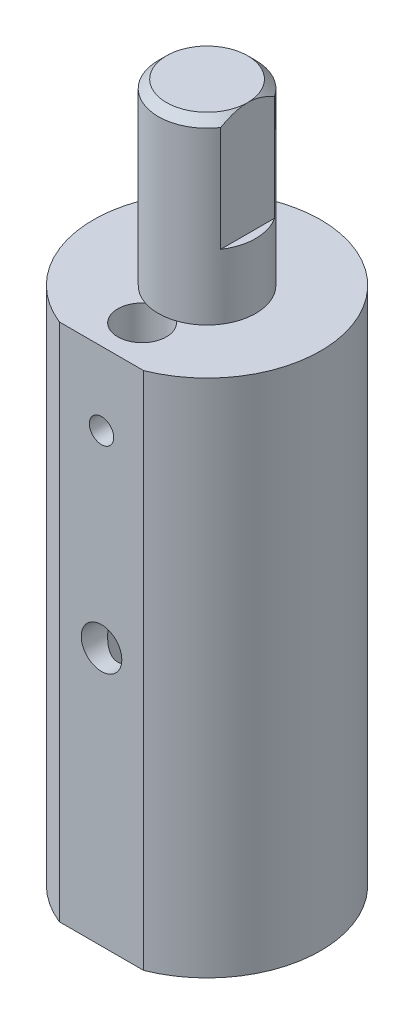
ISO-10303-21;
HEADER;
FILE_DESCRIPTION(('STEP AP214'),'2;1');
FILE_NAME('part.step','',(''),(''),'','','');
FILE_SCHEMA(('AUTOMOTIVE_DESIGN { 1 0 10303 214 1 1 1 1 }'));
ENDSEC;
DATA;
#1=APPLICATION_CONTEXT('core data for automotive mechanical design processes');
#2=APPLICATION_PROTOCOL_DEFINITION('international standard','automotive_design',2000,#1);
#3=PRODUCT_CONTEXT('',#1,'mechanical');
#4=PRODUCT('Part','Part','',(#3));
#5=PRODUCT_RELATED_PRODUCT_CATEGORY('part','',(#4));
#6=PRODUCT_DEFINITION_FORMATION('','',#4);
#7=PRODUCT_DEFINITION_CONTEXT('part definition',#1,'design');
#8=PRODUCT_DEFINITION('design','',#6,#7);
#9=PRODUCT_DEFINITION_SHAPE('','',#8);
#10=(LENGTH_UNIT() NAMED_UNIT(*) SI_UNIT(.MILLI.,.METRE.));
#11=(NAMED_UNIT(*) PLANE_ANGLE_UNIT() SI_UNIT($,.RADIAN.));
#12=(NAMED_UNIT(*) SI_UNIT($,.STERADIAN.) SOLID_ANGLE_UNIT());
#13=UNCERTAINTY_MEASURE_WITH_UNIT(LENGTH_MEASURE(1.E-05),#10,'distance_accuracy_value','');
#14=(GEOMETRIC_REPRESENTATION_CONTEXT(3) GLOBAL_UNCERTAINTY_ASSIGNED_CONTEXT((#13)) GLOBAL_UNIT_ASSIGNED_CONTEXT((#10,
#11,#12)) REPRESENTATION_CONTEXT('',''));
#15=CARTESIAN_POINT('',(0.,0.,0.));
#16=DIRECTION('',(0.,0.,1.));
#17=DIRECTION('',(1.,0.,0.));
#18=AXIS2_PLACEMENT_3D('',#15,#16,#17);
#19=CARTESIAN_POINT('',(0.,0.,0.));
#20=DIRECTION('',(0.,1.,0.));
#21=DIRECTION('',(0.,0.,1.));
#22=AXIS2_PLACEMENT_3D('',#19,#20,#21);
#23=PLANE('',#22);
#24=CARTESIAN_POINT('',(0.,0.,0.));
#25=DIRECTION('',(0.,1.,0.));
#26=DIRECTION('',(0.,0.,1.));
#27=AXIS2_PLACEMENT_3D('',#24,#25,#26);
#28=CIRCLE('',#27,14.);
#29=CARTESIAN_POINT('',(5.19615242270663,0.,13.));
#30=VERTEX_POINT('',#29);
#31=CARTESIAN_POINT('',(-5.19615242270663,0.,13.));
#32=VERTEX_POINT('',#31);
#33=EDGE_CURVE('E142',#30,#32,#28,.T.);
#34=ORIENTED_EDGE('',*,*,#33,.F.);
#35=DIRECTION('',(1.,0.,0.));
#36=VECTOR('',#35,1.);
#37=CARTESIAN_POINT('',(5.19615242270663,0.,13.));
#38=LINE('',#37,#36);
#39=EDGE_CURVE('E145',#32,#30,#38,.T.);
#40=ORIENTED_EDGE('',*,*,#39,.F.);
#41=EDGE_LOOP('',(#34,#40));
#42=FACE_BOUND('',#41,.T.);
#43=CARTESIAN_POINT('',(-9.,0.,0.));
#44=DIRECTION('',(0.,1.,0.));
#45=DIRECTION('',(0.,0.,1.));
#46=AXIS2_PLACEMENT_3D('',#43,#44,#45);
#47=CIRCLE('',#46,2.);
#48=CARTESIAN_POINT('',(-9.,0.,2.));
#49=VERTEX_POINT('',#48);
#50=EDGE_CURVE('E137',#49,#49,#47,.T.);
#51=ORIENTED_EDGE('',*,*,#50,.T.);
#52=EDGE_LOOP('',(#51));
#53=FACE_BOUND('',#52,.T.);
#54=CARTESIAN_POINT('',(9.,0.,0.));
#55=DIRECTION('',(0.,1.,0.));
#56=DIRECTION('',(0.,0.,1.));
#57=AXIS2_PLACEMENT_3D('',#54,#55,#56);
#58=CIRCLE('',#57,2.);
#59=CARTESIAN_POINT('',(9.,0.,2.));
#60=VERTEX_POINT('',#59);
#61=EDGE_CURVE('E132',#60,#60,#58,.T.);
#62=ORIENTED_EDGE('',*,*,#61,.T.);
#63=EDGE_LOOP('',(#62));
#64=FACE_BOUND('',#63,.T.);
#65=CARTESIAN_POINT('',(0.,0.,-5.));
#66=DIRECTION('',(0.,1.,0.));
#67=DIRECTION('',(0.,0.,1.));
#68=AXIS2_PLACEMENT_3D('',#65,#66,#67);
#69=CIRCLE('',#68,6.);
#70=CARTESIAN_POINT('',(0.,0.,1.));
#71=VERTEX_POINT('',#70);
#72=EDGE_CURVE('E128',#71,#71,#69,.T.);
#73=ORIENTED_EDGE('',*,*,#72,.T.);
#74=EDGE_LOOP('',(#73));
#75=FACE_BOUND('',#74,.T.);
#76=CARTESIAN_POINT('',(0.,0.,8.));
#77=DIRECTION('',(0.,1.,0.));
#78=DIRECTION('',(0.,0.,1.));
#79=AXIS2_PLACEMENT_3D('',#76,#77,#78);
#80=CIRCLE('',#79,3.);
#81=CARTESIAN_POINT('',(0.,0.,11.));
#82=VERTEX_POINT('',#81);
#83=EDGE_CURVE('E125',#82,#82,#80,.T.);
#84=ORIENTED_EDGE('',*,*,#83,.T.);
#85=EDGE_LOOP('',(#84));
#86=FACE_BOUND('',#85,.T.);
#87=ADVANCED_FACE('F35',(#42,#53,#64,#75,#86),#23,.F.);
#88=CARTESIAN_POINT('',(0.,14.,0.));
#89=DIRECTION('',(0.,-1.,0.));
#90=DIRECTION('',(0.,0.,-1.));
#91=AXIS2_PLACEMENT_3D('',#88,#89,#90);
#92=CYLINDRICAL_SURFACE('',#91,14.);
#93=ORIENTED_EDGE('',*,*,#33,.T.);
#94=DIRECTION('',(0.,-1.,0.));
#95=VECTOR('',#94,1.);
#96=CARTESIAN_POINT('',(-5.19615242270663,14.,13.));
#97=LINE('',#96,#95);
#98=CARTESIAN_POINT('',(-5.19615242270664,64.,13.));
#99=VERTEX_POINT('',#98);
#100=EDGE_CURVE('E150',#99,#32,#97,.T.);
#101=ORIENTED_EDGE('',*,*,#100,.F.);
#102=CARTESIAN_POINT('',(0.,64.,0.));
#103=DIRECTION('',(0.,1.,0.));
#104=DIRECTION('',(0.,0.,1.));
#105=AXIS2_PLACEMENT_3D('',#102,#103,#104);
#106=CIRCLE('',#105,14.);
#107=CARTESIAN_POINT('',(5.19615242270663,64.,13.));
#108=VERTEX_POINT('',#107);
#109=EDGE_CURVE('E115',#108,#99,#106,.T.);
#110=ORIENTED_EDGE('',*,*,#109,.F.);
#111=DIRECTION('',(0.,-1.,0.));
#112=VECTOR('',#111,1.);
#113=CARTESIAN_POINT('',(5.19615242270663,14.,13.));
#114=LINE('',#113,#112);
#115=EDGE_CURVE('E147',#108,#30,#114,.T.);
#116=ORIENTED_EDGE('',*,*,#115,.T.);
#117=EDGE_LOOP('',(#93,#101,#110,#116));
#118=FACE_BOUND('',#117,.T.);
#119=ADVANCED_FACE('F233',(#118),#92,.T.);
#120=CARTESIAN_POINT('',(5.19615242270663,14.,13.));
#121=DIRECTION('',(0.,0.,-1.));
#122=DIRECTION('',(-1.,0.,0.));
#123=AXIS2_PLACEMENT_3D('',#120,#121,#122);
#124=PLANE('',#123);
#125=CARTESIAN_POINT('',(0.,55.,13.));
#126=DIRECTION('',(0.,0.,1.));
#127=DIRECTION('',(1.,0.,0.));
#128=AXIS2_PLACEMENT_3D('',#125,#126,#127);
#129=CIRCLE('',#128,1.5);
#130=CARTESIAN_POINT('',(1.5,55.,13.));
#131=VERTEX_POINT('',#130);
#132=EDGE_CURVE('E256',#131,#131,#129,.T.);
#133=ORIENTED_EDGE('',*,*,#132,.F.);
#134=EDGE_LOOP('',(#133));
#135=FACE_BOUND('',#134,.T.);
#136=CARTESIAN_POINT('',(0.,31.8006063548459,13.));
#137=DIRECTION('',(0.,0.,1.));
#138=DIRECTION('',(1.,0.,0.));
#139=AXIS2_PLACEMENT_3D('',#136,#137,#138);
#140=CIRCLE('',#139,2.5);
#141=CARTESIAN_POINT('',(2.5,31.8006063548459,13.));
#142=VERTEX_POINT('',#141);
#143=EDGE_CURVE('E260',#142,#142,#140,.T.);
#144=ORIENTED_EDGE('',*,*,#143,.F.);
#145=EDGE_LOOP('',(#144));
#146=FACE_BOUND('',#145,.T.);
#147=ORIENTED_EDGE('',*,*,#39,.T.);
#148=ORIENTED_EDGE('',*,*,#115,.F.);
#149=DIRECTION('',(1.,0.,0.));
#150=VECTOR('',#149,1.);
#151=CARTESIAN_POINT('',(-5.19615242270664,64.,13.));
#152=LINE('',#151,#150);
#153=EDGE_CURVE('E118',#99,#108,#152,.T.);
#154=ORIENTED_EDGE('',*,*,#153,.F.);
#155=ORIENTED_EDGE('',*,*,#100,.T.);
#156=EDGE_LOOP('',(#147,#148,#154,#155));
#157=FACE_BOUND('',#156,.T.);
#158=ADVANCED_FACE('F239',(#135,#146,#157),#124,.F.);
#159=CARTESIAN_POINT('',(-9.,14.,0.));
#160=DIRECTION('',(0.,-1.,0.));
#161=DIRECTION('',(0.,0.,-1.));
#162=AXIS2_PLACEMENT_3D('',#159,#160,#161);
#163=CYLINDRICAL_SURFACE('',#162,2.);
#164=CARTESIAN_POINT('',(-9.,14.,0.));
#165=DIRECTION('',(0.,1.,0.));
#166=DIRECTION('',(0.,0.,1.));
#167=AXIS2_PLACEMENT_3D('',#164,#165,#166);
#168=CIRCLE('',#167,2.);
#169=CARTESIAN_POINT('',(-9.,14.,2.));
#170=VERTEX_POINT('',#169);
#171=EDGE_CURVE('E129',#170,#170,#168,.T.);
#172=ORIENTED_EDGE('',*,*,#171,.T.);
#173=EDGE_LOOP('',(#172));
#174=FACE_BOUND('',#173,.T.);
#175=ORIENTED_EDGE('',*,*,#50,.F.);
#176=EDGE_LOOP('',(#175));
#177=FACE_BOUND('',#176,.T.);
#178=ADVANCED_FACE('F245',(#174,#177),#163,.F.);
#179=CARTESIAN_POINT('',(9.,14.,0.));
#180=DIRECTION('',(0.,-1.,0.));
#181=DIRECTION('',(0.,0.,-1.));
#182=AXIS2_PLACEMENT_3D('',#179,#180,#181);
#183=CYLINDRICAL_SURFACE('',#182,2.);
#184=CARTESIAN_POINT('',(9.,14.,0.));
#185=DIRECTION('',(0.,1.,0.));
#186=DIRECTION('',(0.,0.,1.));
#187=AXIS2_PLACEMENT_3D('',#184,#185,#186);
#188=CIRCLE('',#187,2.);
#189=CARTESIAN_POINT('',(9.,14.,2.));
#190=VERTEX_POINT('',#189);
#191=EDGE_CURVE('E124',#190,#190,#188,.T.);
#192=ORIENTED_EDGE('',*,*,#191,.T.);
#193=EDGE_LOOP('',(#192));
#194=FACE_BOUND('',#193,.T.);
#195=ORIENTED_EDGE('',*,*,#61,.F.);
#196=EDGE_LOOP('',(#195));
#197=FACE_BOUND('',#196,.T.);
#198=ADVANCED_FACE('F251',(#194,#197),#183,.F.);
#199=CARTESIAN_POINT('',(0.,14.,-5.));
#200=DIRECTION('',(0.,-1.,0.));
#201=DIRECTION('',(0.,0.,-1.));
#202=AXIS2_PLACEMENT_3D('',#199,#200,#201);
#203=CYLINDRICAL_SURFACE('',#202,6.);
#204=ORIENTED_EDGE('',*,*,#72,.F.);
#205=EDGE_LOOP('',(#204));
#206=FACE_BOUND('',#205,.T.);
#207=CARTESIAN_POINT('',(0.,52.,-5.));
#208=DIRECTION('',(0.,1.,0.));
#209=DIRECTION('',(0.,0.,1.));
#210=AXIS2_PLACEMENT_3D('',#207,#208,#209);
#211=CIRCLE('',#210,6.);
#212=CARTESIAN_POINT('',(0.,52.,1.));
#213=VERTEX_POINT('',#212);
#214=EDGE_CURVE('E121',#213,#213,#211,.T.);
#215=ORIENTED_EDGE('',*,*,#214,.T.);
#216=EDGE_LOOP('',(#215));
#217=FACE_BOUND('',#216,.T.);
#218=ADVANCED_FACE('F199',(#206,#217),#203,.F.);
#219=CARTESIAN_POINT('',(0.,14.,8.));
#220=DIRECTION('',(0.,-1.,0.));
#221=DIRECTION('',(0.,0.,-1.));
#222=AXIS2_PLACEMENT_3D('',#219,#220,#221);
#223=CYLINDRICAL_SURFACE('',#222,3.);
#224=CARTESIAN_POINT('',(0.,56.5,5.));
#225=CARTESIAN_POINT('',(-0.07885794442685,56.4999950465242,5.00000429892438));
#226=CARTESIAN_POINT('',(-0.157809899546343,56.4937448903184,5.00314263470365));
#227=CARTESIAN_POINT('',(-0.313380352903344,56.4690206794877,5.01538765944264));
#228=CARTESIAN_POINT('',(-0.389994130070445,56.4505234105033,5.02450568256621));
#229=CARTESIAN_POINT('',(-0.538400317320673,56.4022092870751,5.04775580894937));
#230=CARTESIAN_POINT('',(-0.610210204408717,56.372436423628,5.06186841233694));
#231=CARTESIAN_POINT('',(-0.747708925209896,56.3026440679525,5.09381335226358));
#232=CARTESIAN_POINT('',(-0.813398240985087,56.2626253836267,5.11164539549712));
#233=CARTESIAN_POINT('',(-0.941261726642866,56.1707241257721,5.15065612612907));
#234=CARTESIAN_POINT('',(-1.00298281668317,56.1182702811405,5.17197201308694));
#235=CARTESIAN_POINT('',(-1.11716916730047,56.0042177811294,5.21510044629886));
#236=CARTESIAN_POINT('',(-1.16962737466015,55.9426122223413,5.23691335686448));
#237=CARTESIAN_POINT('',(-1.26787800067542,55.8062749757149,5.28051573203979));
#238=CARTESIAN_POINT('',(-1.31283800332746,55.7308958524811,5.30217219544802));
#239=CARTESIAN_POINT('',(-1.38925234033605,55.5724489960207,5.34071031841519));
#240=CARTESIAN_POINT('',(-1.4207163224495,55.4893868069159,5.35759538589516));
#241=CARTESIAN_POINT('',(-1.46719866328288,55.3230023418671,5.38313199443287));
#242=CARTESIAN_POINT('',(-1.48308878562066,55.2399933218989,5.3922159262443));
#243=CARTESIAN_POINT('',(-1.50064048996327,55.0720317433308,5.40227165077208));
#244=CARTESIAN_POINT('',(-1.50231613255961,54.9870811886933,5.40325145985068));
#245=CARTESIAN_POINT('',(-1.49203093075844,54.8285709635269,5.39733604614127));
#246=CARTESIAN_POINT('',(-1.48167683930523,54.7548639531654,5.3913685450698));
#247=CARTESIAN_POINT('',(-1.4504097735854,54.6104171359404,5.37385656899225));
#248=CARTESIAN_POINT('',(-1.42949343584648,54.539678282042,5.36231031752336));
#249=CARTESIAN_POINT('',(-1.37731467057901,54.4011563011515,5.33468785380888));
#250=CARTESIAN_POINT('',(-1.34582260067399,54.3334804018213,5.31851239004002));
#251=CARTESIAN_POINT('',(-1.273562531502,54.204048561115,5.28344893577895));
#252=CARTESIAN_POINT('',(-1.2327903657187,54.1422952965999,5.26455972829714));
#253=CARTESIAN_POINT('',(-1.13709908236919,54.0182181208852,5.22330263145072));
#254=CARTESIAN_POINT('',(-1.08104168755393,53.9568146896358,5.20079734644881));
#255=CARTESIAN_POINT('',(-0.959333368112064,53.8438968721136,5.15678565049389));
#256=CARTESIAN_POINT('',(-0.893677884861432,53.7923872119492,5.13527972061799));
#257=CARTESIAN_POINT('',(-0.750774758747777,53.6984715084554,5.09447019075554));
#258=CARTESIAN_POINT('',(-0.673130387399118,53.6565992913314,5.07531523756989));
#259=CARTESIAN_POINT('',(-0.510699323233199,53.5868544564355,5.04263178318137));
#260=CARTESIAN_POINT('',(-0.425918364397917,53.5589707224773,5.0290988158467));
#261=CARTESIAN_POINT('',(-0.259149737491056,53.520286894425,5.01013499387847));
#262=CARTESIAN_POINT('',(-0.177512295822491,53.5082631463798,5.00412592548035));
#263=CARTESIAN_POINT('',(-0.0131693999240289,53.4978029032983,4.99890479811345));
#264=CARTESIAN_POINT('',(0.0695355298048618,53.4993599715408,4.99968951918022));
#265=CARTESIAN_POINT('',(0.22684945797898,53.5153100326281,5.00763211619848));
#266=CARTESIAN_POINT('',(0.301589112074895,53.528698799095,5.01429131467748));
#267=CARTESIAN_POINT('',(0.447610338452911,53.5663571078427,5.0326674302774));
#268=CARTESIAN_POINT('',(0.518891528536629,53.5906278496802,5.04438490498382));
#269=CARTESIAN_POINT('',(0.658332912674358,53.6499976996496,5.07223622879618));
#270=CARTESIAN_POINT('',(0.726345595508705,53.6853865751744,5.08848677345554));
#271=CARTESIAN_POINT('',(0.855692042548907,53.7656613034699,5.12384038523874));
#272=CARTESIAN_POINT('',(0.917022944664886,53.8105512018931,5.14294466649593));
#273=CARTESIAN_POINT('',(1.03765153393382,53.9136406379961,5.18437667995703));
#274=CARTESIAN_POINT('',(1.09615811672854,53.9727143026677,5.20683672734751));
#275=CARTESIAN_POINT('',(1.20278448167828,54.0998877269166,5.2510641258677));
#276=CARTESIAN_POINT('',(1.25089707856781,54.1679936782719,5.27283098899929));
#277=CARTESIAN_POINT('',(1.33756187171853,54.3154654812595,5.31423211690266));
#278=CARTESIAN_POINT('',(1.37553824370037,54.3952168991417,5.33371205616409));
#279=CARTESIAN_POINT('',(1.43712423890206,54.5612651013625,5.36638891558798));
#280=CARTESIAN_POINT('',(1.46075237380053,54.6475532897003,5.37959392667375));
#281=CARTESIAN_POINT('',(1.49079253120031,54.8153653343271,5.39657748461297));
#282=CARTESIAN_POINT('',(1.49863949460818,54.8965513801529,5.40113924802403));
#283=CARTESIAN_POINT('',(1.5010337315643,55.0591706007468,5.40251968037595));
#284=CARTESIAN_POINT('',(1.49558676993486,55.1406036531068,5.39934170560415));
#285=CARTESIAN_POINT('',(1.47288918838997,55.2932252523002,5.38643206923385));
#286=CARTESIAN_POINT('',(1.45681247151455,55.3646507052171,5.37735358276012));
#287=CARTESIAN_POINT('',(1.41476303733662,55.5037121791365,5.35443475718521));
#288=CARTESIAN_POINT('',(1.38878713673988,55.571346973138,5.34059288645497));
#289=CARTESIAN_POINT('',(1.32572361795085,55.7059372764798,5.30857204453196));
#290=CARTESIAN_POINT('',(1.28800670672355,55.7725418527435,5.29016416406119));
#291=CARTESIAN_POINT('',(1.20322645745609,55.8989118042719,5.25147002547709));
#292=CARTESIAN_POINT('',(1.15615825686235,55.9586735957817,5.23118279306584));
#293=CARTESIAN_POINT('',(1.04730498999206,56.077212973532,5.18806515262862));
#294=CARTESIAN_POINT('',(0.984426634495895,56.1349886535254,5.16522525040058));
#295=CARTESIAN_POINT('',(0.849232209349798,56.2393944751529,5.12183371610104));
#296=CARTESIAN_POINT('',(0.776911084957799,56.2860186092049,5.10128332060707));
#297=CARTESIAN_POINT('',(0.623897395174422,56.3668545440681,5.06452985650194));
#298=CARTESIAN_POINT('',(0.543149255665099,56.4009762538547,5.04835855259101));
#299=CARTESIAN_POINT('',(0.376113151707132,56.4547122516361,5.0224798805152));
#300=CARTESIAN_POINT('',(0.289841699383652,56.4743677702086,5.01275414955398));
#301=CARTESIAN_POINT('',(0.168902919736344,56.4908461166286,5.00456807129783));
#302=CARTESIAN_POINT('',(0.135242819162348,56.4942739612995,5.00285951989624));
#303=CARTESIAN_POINT('',(0.0677275977076377,56.4988519982711,5.00057454534777));
#304=CARTESIAN_POINT('',(0.0338724714699428,56.5000021277053,4.99999815344929));
#305=CARTESIAN_POINT('',(0.,56.5,5.));
#306=B_SPLINE_CURVE_WITH_KNOTS('',3,(#224,#225,#226,#227,#228,#229,#230,#231,#232,#233,#234,
#235,#236,#237,#238,#239,#240,#241,#242,#243,#244,#245,#246,#247,#248,#249,#250,#251,#252,#253,
#254,#255,#256,#257,#258,#259,#260,#261,#262,#263,#264,#265,#266,#267,#268,#269,#270,#271,#272,
#273,#274,#275,#276,#277,#278,#279,#280,#281,#282,#283,#284,#285,#286,#287,#288,#289,#290,#291,
#292,#293,#294,#295,#296,#297,#298,#299,#300,#301,#302,#303,#304,#305),.UNSPECIFIED.,.T.,.F.,(4,
2,2,2,2,2,2,2,2,2,2,2,2,2,2,2,2,2,2,2,2,2,2,2,2,2,2,2,2,2,2,2,2,2,2,2,2,2,2,2,4),(0.,
0.236436386130439,0.473322224563796,0.709293233238446,0.945245640872353,1.19547263807714,
1.44588935648105,1.71572589646129,1.98536921847422,2.23887018210344,2.4921203599353,
2.71508568613981,2.93812205888518,3.16635360252731,3.39468781890332,3.65197412000817,
3.9093830189803,4.17874533321661,4.44789325368419,4.69474935707019,4.94148846767214,
5.16910359759183,5.39674382446398,5.63089284041848,5.86514176122509,6.12239415966628,
6.37982382923148,6.64972023242589,6.91926767918176,7.1629396125457,7.40650589797018,
7.62686895373284,7.84730293182528,8.08254685170431,8.31791341715446,8.58187864135757,
8.84598575071869,9.1119602049529,9.37717362931724,9.47872920200876,9.58028757766599),.UNSPECIFIED.);
#307=CARTESIAN_POINT('',(0.,56.5,5.));
#308=VERTEX_POINT('',#307);
#309=EDGE_CURVE('E41',#308,#308,#306,.T.);
#310=ORIENTED_EDGE('',*,*,#309,.F.);
#311=EDGE_LOOP('',(#310));
#312=FACE_BOUND('',#311,.T.);
#313=CARTESIAN_POINT('',(1.5,55.,10.5980762113533));
#314=CARTESIAN_POINT('',(1.4999945446118,54.9218382877071,10.5980830209269));
#315=CARTESIAN_POINT('',(1.49384995609983,54.8435778827124,10.6016570178163));
#316=CARTESIAN_POINT('',(1.46958481484708,54.6894591029843,10.6154354967808));
#317=CARTESIAN_POINT('',(1.45143909683127,54.6136061274349,10.6256539108334));
#318=CARTESIAN_POINT('',(1.40414992304972,54.4668225034841,10.651240199081));
#319=CARTESIAN_POINT('',(1.3750649287406,54.3958680212896,10.6665806520988));
#320=CARTESIAN_POINT('',(1.30690128806456,54.2598636970049,10.7006399722529));
#321=CARTESIAN_POINT('',(1.26782210105367,54.1948141746063,10.719359022141));
#322=CARTESIAN_POINT('',(1.17699981079633,54.0665414071637,10.7599530358616));
#323=CARTESIAN_POINT('',(1.12447805421566,54.0039112964897,10.7819609545693));
#324=CARTESIAN_POINT('',(1.00988071142171,53.8878874173899,10.8255797417856));
#325=CARTESIAN_POINT('',(0.947800388673443,53.8344982561247,10.8471904074687));
#326=CARTESIAN_POINT('',(0.81073434512182,53.7349492732785,10.8893221542942));
#327=CARTESIAN_POINT('',(0.735160783518863,53.6895193482107,10.9096715962726));
#328=CARTESIAN_POINT('',(0.576235539899258,53.6122887201314,10.9452613414929));
#329=CARTESIAN_POINT('',(0.492888807207235,53.5804794157942,10.9605048677561));
#330=CARTESIAN_POINT('',(0.327067415888969,53.5337430080484,10.9832069186636));
#331=CARTESIAN_POINT('',(0.24495268573323,53.5177757104667,10.9911422033134));
#332=CARTESIAN_POINT('',(0.0788559430467773,53.4997508219874,11.000113757691));
#333=CARTESIAN_POINT('',(-0.00512490876560224,53.4976848148064,11.0011542017688));
#334=CARTESIAN_POINT('',(-0.164748786635619,53.5071200109555,10.9964447287468));
#335=CARTESIAN_POINT('',(-0.240481798765182,53.5174570232818,10.9912774383824));
#336=CARTESIAN_POINT('',(-0.388970657877479,53.549321265857,10.9756136788962));
#337=CARTESIAN_POINT('',(-0.461726281640884,53.5708493334643,10.9651168109959));
#338=CARTESIAN_POINT('',(-0.603464087354327,53.6246238491347,10.9395737493148));
#339=CARTESIAN_POINT('',(-0.672380135272764,53.6570144697581,10.924466622938));
#340=CARTESIAN_POINT('',(-0.803965202269989,53.7313951243022,10.8910646898003));
#341=CARTESIAN_POINT('',(-0.866631973257965,53.7733885949535,10.8727687423623));
#342=CARTESIAN_POINT('',(-0.990260491347288,53.8703430272995,10.8326659159884));
#343=CARTESIAN_POINT('',(-1.05050111254404,53.926154542489,10.8106906399726));
#344=CARTESIAN_POINT('',(-1.16115655544667,54.0468845873953,10.7668151088022));
#345=CARTESIAN_POINT('',(-1.21156381736134,54.1118100584111,10.7449149239844));
#346=CARTESIAN_POINT('',(-1.30425800196332,54.2539722886361,10.7021623413873));
#347=CARTESIAN_POINT('',(-1.34582597246708,54.3317290345813,10.6814647998606));
#348=CARTESIAN_POINT('',(-1.41497866950185,54.4944065070385,10.6456317541786));
#349=CARTESIAN_POINT('',(-1.44257798731633,54.5793196495263,10.630490450691));
#350=CARTESIAN_POINT('',(-1.48077031653756,54.7468217669242,10.6091695372555));
#351=CARTESIAN_POINT('',(-1.49253768317996,54.8290616785653,10.6023748377274));
#352=CARTESIAN_POINT('',(-1.50227541991714,54.9946020122748,10.5967687904241));
#353=CARTESIAN_POINT('',(-1.50025553597254,55.0779016436797,10.5979518033397));
#354=CARTESIAN_POINT('',(-1.48355406501595,55.2334808778681,10.6075150481088));
#355=CARTESIAN_POINT('',(-1.4702817250687,55.3059691766619,10.6150938125998));
#356=CARTESIAN_POINT('',(-1.43354442694866,55.4475516794064,10.6354103232701));
#357=CARTESIAN_POINT('',(-1.41007616793542,55.5166447761199,10.6481497400755));
#358=CARTESIAN_POINT('',(-1.35247138290733,55.653116996354,10.6780433311948));
#359=CARTESIAN_POINT('',(-1.31789109553909,55.7202685252803,10.6953746486459));
#360=CARTESIAN_POINT('',(-1.23943059602371,55.8482039073085,10.7323417924587));
#361=CARTESIAN_POINT('',(-1.19554560649833,55.9089844652699,10.7519788003272));
#362=CARTESIAN_POINT('',(-1.09325575079829,56.0304681512853,10.794319976845));
#363=CARTESIAN_POINT('',(-1.03371790847246,56.0901957260765,10.8170987473143));
#364=CARTESIAN_POINT('',(-0.905106743097438,56.1991183569904,10.8610135246684));
#365=CARTESIAN_POINT('',(-0.836030211983025,56.2483098553458,10.8821489751156));
#366=CARTESIAN_POINT('',(-0.687803043838139,56.3358605889252,10.9211204253644));
#367=CARTESIAN_POINT('',(-0.608434646361172,56.3738996773164,10.9388546250804));
#368=CARTESIAN_POINT('',(-0.443283546961626,56.4357068557861,10.9682503243895));
#369=CARTESIAN_POINT('',(-0.357506552088267,56.4594874770495,10.9799171551456));
#370=CARTESIAN_POINT('',(-0.190469523495629,56.490052846262,10.9950126227282));
#371=CARTESIAN_POINT('',(-0.109517165775689,56.4981968138142,10.9990989186229));
#372=CARTESIAN_POINT('',(0.0526889789268013,56.5012648981816,11.000631955627));
#373=CARTESIAN_POINT('',(0.133942650442626,56.4961936427853,10.9980810210033));
#374=CARTESIAN_POINT('',(0.288806988475717,56.4738753898066,10.9870095325688));
#375=CARTESIAN_POINT('',(0.362568476716893,56.4574527261135,10.9788934200198));
#376=CARTESIAN_POINT('',(0.506168928275424,56.4140095010455,10.9578814049513));
#377=CARTESIAN_POINT('',(0.576007327433261,56.3869874198598,10.9449848169919));
#378=CARTESIAN_POINT('',(0.713135109367324,56.321909421751,10.9148889612218));
#379=CARTESIAN_POINT('',(0.780187714050066,56.2834310151882,10.897529257982));
#380=CARTESIAN_POINT('',(0.907161962721034,56.1970631037114,10.8603219971274));
#381=CARTESIAN_POINT('',(0.967080311122358,56.1491692763265,10.8404732983754));
#382=CARTESIAN_POINT('',(1.08437100623533,56.039804291466,10.7979291533994));
#383=CARTESIAN_POINT('',(1.1408965268089,55.9774562687842,10.7751469851755));
#384=CARTESIAN_POINT('',(1.24299493109201,55.8438239183053,10.7309461424428));
#385=CARTESIAN_POINT('',(1.28855812501508,55.7725317686985,10.709528686428));
#386=CARTESIAN_POINT('',(1.36864661967848,55.6200450301286,10.6699940795737));
#387=CARTESIAN_POINT('',(1.40277759894141,55.5386087033069,10.6520026138441));
#388=CARTESIAN_POINT('',(1.45631806425962,55.3700013934903,10.6229923449253));
#389=CARTESIAN_POINT('',(1.47577678676302,55.282850666631,10.6119502422155));
#390=CARTESIAN_POINT('',(1.49155051179662,55.162291966522,10.6029390890269));
#391=CARTESIAN_POINT('',(1.49471415744578,55.1299481584032,10.6011219350773));
#392=CARTESIAN_POINT('',(1.49894010763495,55.0650752789766,10.5986890383163));
#393=CARTESIAN_POINT('',(1.50000227159981,55.0325461954212,10.5980733758766));
#394=CARTESIAN_POINT('',(1.5,55.,10.5980762113533));
#395=B_SPLINE_CURVE_WITH_KNOTS('',3,(#313,#314,#315,#316,#317,#318,#319,#320,#321,#322,#323,
#324,#325,#326,#327,#328,#329,#330,#331,#332,#333,#334,#335,#336,#337,#338,#339,#340,#341,#342,
#343,#344,#345,#346,#347,#348,#349,#350,#351,#352,#353,#354,#355,#356,#357,#358,#359,#360,#361,
#362,#363,#364,#365,#366,#367,#368,#369,#370,#371,#372,#373,#374,#375,#376,#377,#378,#379,#380,
#381,#382,#383,#384,#385,#386,#387,#388,#389,#390,#391,#392,#393,#394),.UNSPECIFIED.,.T.,.F.,(4,
2,2,2,2,2,2,2,2,2,2,2,2,2,2,2,2,2,2,2,2,2,2,2,2,2,2,2,2,2,2,2,2,2,2,2,2,2,2,2,4),(0.,
0.234348183892072,0.469189339237203,0.702792893878319,0.93640908816771,1.18929346874734,
1.44230356626556,1.71236838358145,1.98226240445836,2.23295227451902,2.48349035529059,
2.71224146226807,2.94100968776182,3.1729430209672,3.40495949025407,3.65890787185335,
3.91305072368877,4.18333262594172,4.45333161317557,4.70193436281317,4.95036139782559,
5.17161275136038,5.39293578654095,5.62450944609131,5.8562022933007,6.11710115370919,
6.37808797467303,6.64596272119449,6.91360169713157,7.1566840558423,7.39968130190957,
7.62666637307239,7.85368400268019,8.09041126079208,8.32724745151078,8.587653627751,
8.84828914267731,9.11716123557907,9.3851269950414,9.48270202777964,9.58028358741811),.UNSPECIFIED.);
#396=CARTESIAN_POINT('',(1.5,55.,10.5980762113533));
#397=VERTEX_POINT('',#396);
#398=EDGE_CURVE('E208',#397,#397,#395,.T.);
#399=ORIENTED_EDGE('',*,*,#398,.F.);
#400=EDGE_LOOP('',(#399));
#401=FACE_BOUND('',#400,.T.);
#402=CARTESIAN_POINT('',(2.5,31.8006063548459,9.6583123951777));
#403=CARTESIAN_POINT('',(2.49999381779257,31.7123019446603,9.65832848527777));
#404=CARTESIAN_POINT('',(2.49526266006825,31.623846568836,9.66552106867759));
#405=CARTESIAN_POINT('',(2.47682990119872,31.4498284709432,9.69279627564257));
#406=CARTESIAN_POINT('',(2.46309747522165,31.3642767551608,9.71292318814633));
#407=CARTESIAN_POINT('',(2.42086856120702,31.1655010442035,9.7723311567861));
#408=CARTESIAN_POINT('',(2.38871146123827,31.0544147003585,9.81601359579225));
#409=CARTESIAN_POINT('',(2.31147102501777,30.8414285382707,9.91336767201443));
#410=CARTESIAN_POINT('',(2.26634586338957,30.7395598701929,9.96707143083861));
#411=CARTESIAN_POINT('',(2.17847435315541,30.5715607408337,10.0633128033891));
#412=CARTESIAN_POINT('',(2.13852895219291,30.5033447634906,10.1048248818501));
#413=CARTESIAN_POINT('',(2.05264418187204,30.3713192544484,10.1886664449236));
#414=CARTESIAN_POINT('',(2.00670223718895,30.3075116341083,10.2309962740409));
#415=CARTESIAN_POINT('',(1.86006177209499,30.1228495872423,10.3572738814359));
#416=CARTESIAN_POINT('',(1.75039822318642,30.0084697224219,10.4406843167698));
#417=CARTESIAN_POINT('',(1.53331236095276,29.8220123490572,10.5810836441165));
#418=CARTESIAN_POINT('',(1.43034863494402,29.746108132266,10.6399240912205));
#419=CARTESIAN_POINT('',(1.21027306497041,29.6092692974537,10.74775790284));
#420=CARTESIAN_POINT('',(1.0931846025589,29.5483104333352,10.7967671928015));
#421=CARTESIAN_POINT('',(0.867930574105457,29.4534934897731,10.8737292379046));
#422=CARTESIAN_POINT('',(0.761720558967919,29.4167723901902,10.9038573073085));
#423=CARTESIAN_POINT('',(0.542834165009174,29.3576259451595,10.9526038261635));
#424=CARTESIAN_POINT('',(0.43016155372626,29.3351923609378,10.9712289085262));
#425=CARTESIAN_POINT('',(0.200906197669829,29.3060048592005,10.9954916019788));
#426=CARTESIAN_POINT('',(0.0843091426465995,29.2993165250983,11.0010748895641));
#427=CARTESIAN_POINT('',(-0.148527393661061,29.3023085999612,10.9985814352968));
#428=CARTESIAN_POINT('',(-0.264766882809714,29.3119886463075,10.9905049960565));
#429=CARTESIAN_POINT('',(-0.485446031322611,29.3458206043896,10.9624133597337));
#430=CARTESIAN_POINT('',(-0.590154005534431,29.3689574726917,10.9432359451617));
#431=CARTESIAN_POINT('',(-0.793626256853984,29.4275541860783,10.895013123589));
#432=CARTESIAN_POINT('',(-0.892389678949306,29.463015798901,10.8659663010324));
#433=CARTESIAN_POINT('',(-1.09053364635439,29.5481975262971,10.7969030545973));
#434=CARTESIAN_POINT('',(-1.18924374927733,29.5988781240101,10.7561606192345));
#435=CARTESIAN_POINT('',(-1.37677917974558,29.7110030477829,10.6674476252738));
#436=CARTESIAN_POINT('',(-1.46559550453314,29.7724570482573,10.6194705755212));
#437=CARTESIAN_POINT('',(-1.67280381279726,29.9360656793201,10.4944878939135));
#438=CARTESIAN_POINT('',(-1.78517417530476,30.0436775782437,10.4145278385683));
#439=CARTESIAN_POINT('',(-1.93670187620853,30.2178466575689,10.2920394536886));
#440=CARTESIAN_POINT('',(-1.98442734415742,30.2781205231529,10.2507263189724));
#441=CARTESIAN_POINT('',(-2.07418694298424,30.4028781403351,10.1682837598648));
#442=CARTESIAN_POINT('',(-2.11622312017878,30.4673603658408,10.1271542745934));
#443=CARTESIAN_POINT('',(-2.21282833126485,30.63172495932,10.0273601392158));
#444=CARTESIAN_POINT('',(-2.26407571910762,30.7340699542798,9.96948181658004));
#445=CARTESIAN_POINT('',(-2.35314050085765,30.9484675263831,9.86213853666711));
#446=CARTESIAN_POINT('',(-2.39099600305927,31.0604914104727,9.81264991817823));
#447=CARTESIAN_POINT('',(-2.4414108954061,31.2564268073579,9.74376607660708));
#448=CARTESIAN_POINT('',(-2.45819358164965,31.3376051051292,9.71981949257404));
#449=CARTESIAN_POINT('',(-2.48370273222149,31.5035675005206,9.68277668804568));
#450=CARTESIAN_POINT('',(-2.49244814091896,31.5883426237408,9.66965496020135));
#451=CARTESIAN_POINT('',(-2.50115517387014,31.7600340614163,9.65659310081955));
#452=CARTESIAN_POINT('',(-2.5010533736449,31.8469613695133,9.65674814862692));
#453=CARTESIAN_POINT('',(-2.49191597272525,32.0193120423594,9.67045143445787));
#454=CARTESIAN_POINT('',(-2.48286800185718,32.104733157976,9.68401821733787));
#455=CARTESIAN_POINT('',(-2.45336046117379,32.2927908121849,9.72679886038489));
#456=CARTESIAN_POINT('',(-2.43059717464989,32.3943313233505,9.75909755109212));
#457=CARTESIAN_POINT('',(-2.37422567983509,32.5902388012453,9.83446297156782));
#458=CARTESIAN_POINT('',(-2.34058163140775,32.6845807695386,9.87756517999229));
#459=CARTESIAN_POINT('',(-2.27197464095645,32.8466011381391,9.95968409590129));
#460=CARTESIAN_POINT('',(-2.23884949579965,32.9156520945936,9.99758766640253));
#461=CARTESIAN_POINT('',(-2.16695951166941,33.0496348520534,10.0753531630308));
#462=CARTESIAN_POINT('',(-2.12819176063911,33.1145645011195,10.1152160932732));
#463=CARTESIAN_POINT('',(-2.04513177456922,33.2404402606724,10.1956272895707));
#464=CARTESIAN_POINT('',(-2.00083502832488,33.3013830556098,10.2361760916142));
#465=CARTESIAN_POINT('',(-1.90679633939304,33.4191913039464,10.3168906893159));
#466=CARTESIAN_POINT('',(-1.85705157250686,33.4760546170641,10.3570562744781));
#467=CARTESIAN_POINT('',(-1.6969147079463,33.6430611900289,10.4776112604394));
#468=CARTESIAN_POINT('',(-1.57762869702064,33.7465438935653,10.556011354204));
#469=CARTESIAN_POINT('',(-1.38213833429723,33.8853269879065,10.6636899482228));
#470=CARTESIAN_POINT('',(-1.3142814425198,33.9288168843599,10.6979035366431));
#471=CARTESIAN_POINT('',(-1.17320567310926,34.0097230958795,10.7621704427754));
#472=CARTESIAN_POINT('',(-1.09999000687013,34.0471430059991,10.7922262214572));
#473=CARTESIAN_POINT('',(-0.923231349702319,34.1265237044894,10.8564276598717));
#474=CARTESIAN_POINT('',(-0.81772990661941,34.1658231789122,10.8885836614525));
#475=CARTESIAN_POINT('',(-0.599797532910342,34.2302426030964,10.9415635053148));
#476=CARTESIAN_POINT('',(-0.487372072128371,34.2553735902843,10.9623961681616));
#477=CARTESIAN_POINT('',(-0.257904014589434,34.289983506691,10.9911375477935));
#478=CARTESIAN_POINT('',(-0.140841922250417,34.2993870699294,10.9989840328167));
#479=CARTESIAN_POINT('',(0.0935504369182315,34.3016019863742,11.000829590641));
#480=CARTESIAN_POINT('',(0.210880683537421,34.2944145513364,10.9948296747411));
#481=CARTESIAN_POINT('',(0.433478999214026,34.2651113078267,10.970475721206));
#482=CARTESIAN_POINT('',(0.539003381840983,34.2441203180871,10.9530528132829));
#483=CARTESIAN_POINT('',(0.744442226622893,34.1895625025821,10.9080705750889));
#484=CARTESIAN_POINT('',(0.844355808688078,34.1559937102087,10.8805096596978));
#485=CARTESIAN_POINT('',(1.04384055152991,34.0749891995638,10.8146434386344));
#486=CARTESIAN_POINT('',(1.14286172854011,34.0267245827411,10.7757040374357));
#487=CARTESIAN_POINT('',(1.33135097301229,33.9194014219623,10.6903980067196));
#488=CARTESIAN_POINT('',(1.42081159008168,33.8603345557729,10.6440256541589));
#489=CARTESIAN_POINT('',(1.63002558091947,33.7025626072201,10.5226485102866));
#490=CARTESIAN_POINT('',(1.74390511945052,33.598379998097,10.4445282047233));
#491=CARTESIAN_POINT('',(1.89807730985019,33.4294526255696,10.3241333194184));
#492=CARTESIAN_POINT('',(1.94675534900064,33.3709350543477,10.2834009850849));
#493=CARTESIAN_POINT('',(2.03855478653209,33.2497648851199,10.2018306844682));
#494=CARTESIAN_POINT('',(2.08167789496708,33.1871135686885,10.16099275466));
#495=CARTESIAN_POINT('',(2.18509588569703,33.0211146663333,10.0574973580043));
#496=CARTESIAN_POINT('',(2.24133685872229,32.9147640064996,9.99554062285106));
#497=CARTESIAN_POINT('',(2.33909634990328,32.6913506701353,9.8799763526203));
#498=CARTESIAN_POINT('',(2.38065496503423,32.5743182837899,9.82634630603961));
#499=CARTESIAN_POINT('',(2.43556494992113,32.3707321183833,9.7519710712173));
#500=CARTESIAN_POINT('',(2.4537026175718,32.2873325626443,9.72624379189026));
#501=CARTESIAN_POINT('',(2.48144437754558,32.1165784860199,9.68613426001934));
#502=CARTESIAN_POINT('',(2.49108129246948,32.0292405579132,9.67170839549487));
#503=CARTESIAN_POINT('',(2.49736160836694,31.9178150300324,9.66228358000322));
#504=CARTESIAN_POINT('',(2.49834926640805,31.8944135299703,9.66079886805539));
#505=CARTESIAN_POINT('',(2.49966934514014,31.8475470354537,9.65881104526667));
#506=CARTESIAN_POINT('',(2.50000164353618,31.8240820299665,9.65830811763413));
#507=CARTESIAN_POINT('',(2.5,31.8006063548459,9.6583123951777));
#508=B_SPLINE_CURVE_WITH_KNOTS('',3,(#402,#403,#404,#405,#406,#407,#408,#409,#410,#411,#412,
#413,#414,#415,#416,#417,#418,#419,#420,#421,#422,#423,#424,#425,#426,#427,#428,#429,#430,#431,
#432,#433,#434,#435,#436,#437,#438,#439,#440,#441,#442,#443,#444,#445,#446,#447,#448,#449,#450,
#451,#452,#453,#454,#455,#456,#457,#458,#459,#460,#461,#462,#463,#464,#465,#466,#467,#468,#469,
#470,#471,#472,#473,#474,#475,#476,#477,#478,#479,#480,#481,#482,#483,#484,#485,#486,#487,#488,
#489,#490,#491,#492,#493,#494,#495,#496,#497,#498,#499,#500,#501,#502,#503,#504,#505,#506,#507),
.UNSPECIFIED.,.T.,.F.,(4,2,2,2,2,2,2,2,2,2,2,2,2,2,2,2,2,2,2,2,2,2,2,2,2,2,2,2,2,2,2,2,2,2,2,2,
2,2,2,2,2,2,2,2,2,2,2,2,2,2,2,2,4),(0.,0.264807486843958,0.53052657785913,0.899311711113914,
1.26929988428696,1.53684271887073,1.80450083499513,2.33872733232382,2.75963734355716,
3.17985991852653,3.52745225260399,3.87484396861114,4.22368012855136,4.57250856061374,
4.89792180788528,5.22338174845522,5.57669292749804,5.93032301720748,6.45212646169812,
6.71375344417634,6.97528607349791,7.35902155845295,7.74165612186458,7.99961659145732,
8.25696746076718,8.51616339578942,8.77571823174392,9.10077852677671,9.42692063321703,
9.68296205217762,9.93913608157882,10.1955205112228,10.4520384827407,10.9775613091595,
11.2398627749287,11.502008316419,11.8517559716833,12.2012307913941,12.5523755496757,
12.903494662228,13.2290536025831,13.5546634671053,13.9038797714121,14.2533662599301,
14.7693582552692,15.0281495003973,15.2868608867408,15.691662084526,16.0953490806584,
16.3618811606765,16.6273795605045,16.697765340701,16.7681642541596),.UNSPECIFIED.);
#509=CARTESIAN_POINT('',(2.5,31.8006063548459,9.6583123951777));
#510=VERTEX_POINT('',#509);
#511=EDGE_CURVE('E96',#510,#510,#508,.T.);
#512=ORIENTED_EDGE('',*,*,#511,.F.);
#513=EDGE_LOOP('',(#512));
#514=FACE_BOUND('',#513,.T.);
#515=ORIENTED_EDGE('',*,*,#83,.F.);
#516=EDGE_LOOP('',(#515));
#517=FACE_BOUND('',#516,.T.);
#518=CARTESIAN_POINT('',(0.,64.,8.));
#519=DIRECTION('',(0.,1.,0.));
#520=DIRECTION('',(0.,0.,1.));
#521=AXIS2_PLACEMENT_3D('',#518,#519,#520);
#522=CIRCLE('',#521,3.);
#523=CARTESIAN_POINT('',(1.91111060642758,64.,5.6875));
#524=VERTEX_POINT('',#523);
#525=CARTESIAN_POINT('',(-1.91111060642758,64.,5.6875));
#526=VERTEX_POINT('',#525);
#527=EDGE_CURVE('E113',#524,#526,#522,.T.);
#528=ORIENTED_EDGE('',*,*,#527,.T.);
#529=EDGE_CURVE('E112',#526,#524,#522,.T.);
#530=ORIENTED_EDGE('',*,*,#529,.T.);
#531=EDGE_LOOP('',(#528,#530));
#532=FACE_BOUND('',#531,.T.);
#533=ADVANCED_FACE('F195',(#312,#401,#514,#517,#532),#223,.F.);
#534=CARTESIAN_POINT('',(0.,14.,0.));
#535=DIRECTION('',(0.,1.,0.));
#536=DIRECTION('',(0.,0.,1.));
#537=AXIS2_PLACEMENT_3D('',#534,#535,#536);
#538=PLANE('',#537);
#539=ORIENTED_EDGE('',*,*,#191,.F.);
#540=EDGE_LOOP('',(#539));
#541=FACE_BOUND('',#540,.T.);
#542=ADVANCED_FACE('F193',(#541),#538,.F.);
#543=ORIENTED_EDGE('',*,*,#171,.F.);
#544=EDGE_LOOP('',(#543));
#545=FACE_BOUND('',#544,.T.);
#546=ADVANCED_FACE('F190',(#545),#538,.F.);
#547=CARTESIAN_POINT('',(0.,52.,0.));
#548=DIRECTION('',(0.,1.,0.));
#549=DIRECTION('',(0.,0.,1.));
#550=AXIS2_PLACEMENT_3D('',#547,#548,#549);
#551=PLANE('',#550);
#552=ORIENTED_EDGE('',*,*,#214,.F.);
#553=EDGE_LOOP('',(#552));
#554=FACE_BOUND('',#553,.T.);
#555=ADVANCED_FACE('F186',(#554),#551,.F.);
#556=CARTESIAN_POINT('',(0.,64.,0.));
#557=DIRECTION('',(0.,1.,0.));
#558=DIRECTION('',(0.,0.,1.));
#559=AXIS2_PLACEMENT_3D('',#556,#557,#558);
#560=PLANE('',#559);
#561=CARTESIAN_POINT('',(0.,64.,0.));
#562=DIRECTION('',(0.,1.,0.));
#563=DIRECTION('',(0.,0.,1.));
#564=AXIS2_PLACEMENT_3D('',#561,#562,#563);
#565=CIRCLE('',#564,6.);
#566=EDGE_CURVE('E109',#524,#526,#565,.T.);
#567=ORIENTED_EDGE('',*,*,#566,.F.);
#568=ORIENTED_EDGE('',*,*,#529,.F.);
#569=EDGE_LOOP('',(#567,#568));
#570=FACE_BOUND('',#569,.T.);
#571=ORIENTED_EDGE('',*,*,#109,.T.);
#572=ORIENTED_EDGE('',*,*,#153,.T.);
#573=EDGE_LOOP('',(#571,#572));
#574=FACE_BOUND('',#573,.T.);
#575=ADVANCED_FACE('F183',(#570,#574),#560,.T.);
#576=CARTESIAN_POINT('',(0.,86.,0.));
#577=DIRECTION('',(0.,-1.,0.));
#578=DIRECTION('',(0.,0.,-1.));
#579=AXIS2_PLACEMENT_3D('',#576,#577,#578);
#580=CYLINDRICAL_SURFACE('',#579,6.);
#581=DIRECTION('',(0.,1.,0.));
#582=VECTOR('',#581,1.);
#583=CARTESIAN_POINT('',(5.,72.,3.3166247903554));
#584=LINE('',#583,#582);
#585=CARTESIAN_POINT('',(5.,72.,3.3166247903554));
#586=VERTEX_POINT('',#585);
#587=CARTESIAN_POINT('',(5.,85.,3.3166247903554));
#588=VERTEX_POINT('',#587);
#589=EDGE_CURVE('E101',#586,#588,#584,.T.);
#590=ORIENTED_EDGE('',*,*,#589,.T.);
#591=CARTESIAN_POINT('',(0.,85.,0.));
#592=DIRECTION('',(0.,1.,0.));
#593=DIRECTION('',(0.,0.,1.));
#594=AXIS2_PLACEMENT_3D('',#591,#592,#593);
#595=CIRCLE('',#594,6.);
#596=CARTESIAN_POINT('',(5.,85.,-3.3166247903554));
#597=VERTEX_POINT('',#596);
#598=EDGE_CURVE('E11',#588,#597,#595,.F.);
#599=ORIENTED_EDGE('',*,*,#598,.T.);
#600=DIRECTION('',(0.,1.,0.));
#601=VECTOR('',#600,1.);
#602=CARTESIAN_POINT('',(5.,72.,-3.3166247903554));
#603=LINE('',#602,#601);
#604=CARTESIAN_POINT('',(5.,72.,-3.3166247903554));
#605=VERTEX_POINT('',#604);
#606=EDGE_CURVE('E99',#605,#597,#603,.T.);
#607=ORIENTED_EDGE('',*,*,#606,.F.);
#608=CARTESIAN_POINT('',(0.,72.,0.));
#609=DIRECTION('',(0.,1.,0.));
#610=DIRECTION('',(0.,0.,1.));
#611=AXIS2_PLACEMENT_3D('',#608,#609,#610);
#612=CIRCLE('',#611,6.);
#613=EDGE_CURVE('E92',#586,#605,#612,.T.);
#614=ORIENTED_EDGE('',*,*,#613,.F.);
#615=EDGE_LOOP('',(#590,#599,#607,#614));
#616=FACE_BOUND('',#615,.T.);
#617=ORIENTED_EDGE('',*,*,#566,.T.);
#618=EDGE_CURVE('E106',#526,#524,#565,.T.);
#619=ORIENTED_EDGE('',*,*,#618,.T.);
#620=EDGE_LOOP('',(#617,#619));
#621=FACE_BOUND('',#620,.T.);
#622=ADVANCED_FACE('F103',(#616,#621),#580,.T.);
#623=CARTESIAN_POINT('',(0.,86.,0.));
#624=DIRECTION('',(0.,1.,0.));
#625=DIRECTION('',(0.,0.,1.));
#626=AXIS2_PLACEMENT_3D('',#623,#624,#625);
#627=PLANE('',#626);
#628=CARTESIAN_POINT('',(0.,86.,0.));
#629=DIRECTION('',(0.,1.,0.));
#630=DIRECTION('',(0.,0.,1.));
#631=AXIS2_PLACEMENT_3D('',#628,#629,#630);
#632=CIRCLE('',#631,4.99999999999999);
#633=CARTESIAN_POINT('',(5.,86.,0.));
#634=VERTEX_POINT('',#633);
#635=EDGE_CURVE('E153',#634,#634,#632,.T.);
#636=ORIENTED_EDGE('',*,*,#635,.T.);
#637=EDGE_LOOP('',(#636));
#638=FACE_BOUND('',#637,.T.);
#639=ADVANCED_FACE('F173',(#638),#627,.T.);
#640=CARTESIAN_POINT('',(0.,64.,0.));
#641=DIRECTION('',(0.,1.,0.));
#642=DIRECTION('',(0.,0.,1.));
#643=AXIS2_PLACEMENT_3D('',#640,#641,#642);
#644=PLANE('',#643);
#645=ORIENTED_EDGE('',*,*,#527,.F.);
#646=ORIENTED_EDGE('',*,*,#618,.F.);
#647=EDGE_LOOP('',(#645,#646));
#648=FACE_BOUND('',#647,.T.);
#649=ADVANCED_FACE('F171',(#648),#644,.F.);
#650=CARTESIAN_POINT('',(5.,72.,-3.3166247903554));
#651=DIRECTION('',(-1.,0.,0.));
#652=DIRECTION('',(0.,0.,1.));
#653=AXIS2_PLACEMENT_3D('',#650,#651,#652);
#654=PLANE('',#653);
#655=CARTESIAN_POINT('',(5.,85.,-3.3166247903554));
#656=CARTESIAN_POINT('',(5.,85.0500373169904,-3.22609101803052));
#657=CARTESIAN_POINT('',(5.,85.0989995322551,-3.13495311040107));
#658=CARTESIAN_POINT('',(5.,85.1944240482839,-2.9514194918486));
#659=CARTESIAN_POINT('',(5.,85.2408872068574,-2.85902422634022));
#660=CARTESIAN_POINT('',(5.,85.3311944859544,-2.67245992501286));
#661=CARTESIAN_POINT('',(5.,85.3750263638931,-2.57828493109434));
#662=CARTESIAN_POINT('',(5.,85.4594746196151,-2.38844118263173));
#663=CARTESIAN_POINT('',(5.,85.5000890994464,-2.29277158566882));
#664=CARTESIAN_POINT('',(5.,85.6143320741457,-2.00871906771069));
#665=CARTESIAN_POINT('',(5.,85.6828516855855,-1.81823269013493));
#666=CARTESIAN_POINT('',(5.,85.8022505188429,-1.43185590891736));
#667=CARTESIAN_POINT('',(5.,85.8531464202451,-1.2359708054341));
#668=CARTESIAN_POINT('',(5.,85.9106544825512,-0.953085513764609));
#669=CARTESIAN_POINT('',(5.,85.925954768976,-0.867809623329645));
#670=CARTESIAN_POINT('',(5.,85.9524153653313,-0.696604368410864));
#671=CARTESIAN_POINT('',(5.,85.9635754509096,-0.610674968771621));
#672=CARTESIAN_POINT('',(5.,85.9816495223997,-0.437419258030733));
#673=CARTESIAN_POINT('',(5.,85.9885157478458,-0.350087946096616));
#674=CARTESIAN_POINT('',(5.,85.9976988030777,-0.175172973164948));
#675=CARTESIAN_POINT('',(5.,86.0000148879133,-0.0875892731966515));
#676=CARTESIAN_POINT('',(5.,86.,0.));
#677=B_SPLINE_CURVE_WITH_KNOTS('',3,(#655,#656,#657,#658,#659,#660,#661,#662,#663,#664,#665,
#666,#667,#668,#669,#670,#671,#672,#673,#674,#675,#676),.UNSPECIFIED.,.F.,.F.,(4,2,2,2,2,2,2,2,
2,2,4),(0.,0.310328932161107,0.620550654029965,0.932118820104365,1.2438694332414,
1.85049055337935,2.45653597054647,2.71636584969536,2.97620980664009,3.23889486253268,
3.50162292171018),.UNSPECIFIED.);
#678=EDGE_CURVE('E156',#597,#634,#677,.T.);
#679=ORIENTED_EDGE('',*,*,#678,.T.);
#680=CARTESIAN_POINT('',(4.99999999999999,86.,0.));
#681=CARTESIAN_POINT('',(5.,86.00000617326,0.0768342850666808));
#682=CARTESIAN_POINT('',(5.,85.9982280619992,0.153657127576539));
#683=CARTESIAN_POINT('',(5.,85.9911613614478,0.307129286194604));
#684=CARTESIAN_POINT('',(5.,85.9858733324629,0.38377862804028));
#685=CARTESIAN_POINT('',(5.,85.9648596892935,0.612960203544626));
#686=CARTESIAN_POINT('',(5.,85.9439840357443,0.765045586600825));
#687=CARTESIAN_POINT('',(5.,85.8900379911854,1.06446596787187));
#688=CARTESIAN_POINT('',(5.,85.8571680285904,1.21183803867059));
#689=CARTESIAN_POINT('',(5.,85.7806577812992,1.50379337320133));
#690=CARTESIAN_POINT('',(5.,85.7370132975944,1.64837552591509));
#691=CARTESIAN_POINT('',(5.,85.6444828831167,1.92272263441546));
#692=CARTESIAN_POINT('',(5.,85.5963161814298,2.05273331241639));
#693=CARTESIAN_POINT('',(5.,85.4933945412514,2.31011118641952));
#694=CARTESIAN_POINT('',(5.,85.438639320829,2.43747826902536));
#695=CARTESIAN_POINT('',(5.,85.3226900504812,2.69162703776129));
#696=CARTESIAN_POINT('',(5.,85.2614090176275,2.81836872810254));
#697=CARTESIAN_POINT('',(5.,85.1340700930522,3.06932226319914));
#698=CARTESIAN_POINT('',(5.,85.0680156304994,3.19353584349452));
#699=CARTESIAN_POINT('',(5.,85.,3.3166247903554));
#700=B_SPLINE_CURVE_WITH_KNOTS('',3,(#680,#681,#682,#683,#684,#685,#686,#687,#688,#689,#690,
#691,#692,#693,#694,#695,#696,#697,#698,#699),.UNSPECIFIED.,.F.,.F.,(4,2,2,2,2,2,2,2,2,4),(0.,
0.230460410269723,0.460884039831827,0.920776109320089,1.37331103380714,1.82602259780301,
2.2417593096915,2.65751381780303,3.07974200846241,3.50166983486672),.UNSPECIFIED.);
#701=EDGE_CURVE('E51',#634,#588,#700,.T.);
#702=ORIENTED_EDGE('',*,*,#701,.T.);
#703=ORIENTED_EDGE('',*,*,#589,.F.);
#704=DIRECTION('',(0.,0.,1.));
#705=VECTOR('',#704,1.);
#706=CARTESIAN_POINT('',(5.,72.,-3.3166247903554));
#707=LINE('',#706,#705);
#708=EDGE_CURVE('E95',#605,#586,#707,.T.);
#709=ORIENTED_EDGE('',*,*,#708,.F.);
#710=ORIENTED_EDGE('',*,*,#606,.T.);
#711=EDGE_LOOP('',(#679,#702,#703,#709,#710));
#712=FACE_BOUND('',#711,.T.);
#713=ADVANCED_FACE('F98',(#712),#654,.F.);
#714=CARTESIAN_POINT('',(0.,72.,0.));
#715=DIRECTION('',(0.,1.,0.));
#716=DIRECTION('',(0.,0.,1.));
#717=AXIS2_PLACEMENT_3D('',#714,#715,#716);
#718=PLANE('',#717);
#719=ORIENTED_EDGE('',*,*,#613,.T.);
#720=ORIENTED_EDGE('',*,*,#708,.T.);
#721=EDGE_LOOP('',(#719,#720));
#722=FACE_BOUND('',#721,.T.);
#723=ADVANCED_FACE('F94',(#722),#718,.T.);
#724=CARTESIAN_POINT('',(0.,86.,0.));
#725=DIRECTION('',(0.,-1.,0.));
#726=DIRECTION('',(0.,0.,-1.));
#727=AXIS2_PLACEMENT_3D('',#724,#725,#726);
#728=CONICAL_SURFACE('',#727,4.99999999999999,0.785398163397446);
#729=ORIENTED_EDGE('',*,*,#678,.F.);
#730=ORIENTED_EDGE('',*,*,#598,.F.);
#731=ORIENTED_EDGE('',*,*,#701,.F.);
#732=ORIENTED_EDGE('',*,*,#635,.F.);
#733=EDGE_LOOP('',(#729,#730,#731,#732));
#734=FACE_BOUND('',#733,.T.);
#735=ADVANCED_FACE('F38',(#734),#728,.T.);
#736=CARTESIAN_POINT('',(0.,31.8006063548459,8.00000000000001));
#737=DIRECTION('',(0.,0.,1.));
#738=DIRECTION('',(1.,0.,0.));
#739=AXIS2_PLACEMENT_3D('',#736,#737,#738);
#740=CYLINDRICAL_SURFACE('',#739,2.5);
#741=ORIENTED_EDGE('',*,*,#511,.T.);
#742=EDGE_LOOP('',(#741));
#743=FACE_BOUND('',#742,.T.);
#744=ORIENTED_EDGE('',*,*,#143,.T.);
#745=EDGE_LOOP('',(#744));
#746=FACE_BOUND('',#745,.T.);
#747=ADVANCED_FACE('F219',(#743,#746),#740,.F.);
#748=CARTESIAN_POINT('',(0.,55.,-2.));
#749=DIRECTION('',(0.,0.,1.));
#750=DIRECTION('',(1.,0.,0.));
#751=AXIS2_PLACEMENT_3D('',#748,#749,#750);
#752=CYLINDRICAL_SURFACE('',#751,1.5);
#753=ORIENTED_EDGE('',*,*,#398,.T.);
#754=EDGE_LOOP('',(#753));
#755=FACE_BOUND('',#754,.T.);
#756=ORIENTED_EDGE('',*,*,#132,.T.);
#757=EDGE_LOOP('',(#756));
#758=FACE_BOUND('',#757,.T.);
#759=ADVANCED_FACE('F214',(#755,#758),#752,.F.);
#760=ORIENTED_EDGE('',*,*,#309,.T.);
#761=EDGE_LOOP('',(#760));
#762=FACE_BOUND('',#761,.T.);
#763=CARTESIAN_POINT('',(0.,55.,-2.));
#764=DIRECTION('',(0.,0.,1.));
#765=DIRECTION('',(1.,0.,0.));
#766=AXIS2_PLACEMENT_3D('',#763,#764,#765);
#767=CIRCLE('',#766,1.5);
#768=CARTESIAN_POINT('',(1.5,55.,-2.));
#769=VERTEX_POINT('',#768);
#770=EDGE_CURVE('E213',#769,#769,#767,.T.);
#771=ORIENTED_EDGE('',*,*,#770,.F.);
#772=EDGE_LOOP('',(#771));
#773=FACE_BOUND('',#772,.T.);
#774=ADVANCED_FACE('F218',(#762,#773),#752,.F.);
#775=CARTESIAN_POINT('',(0.,55.,-2.));
#776=DIRECTION('',(0.,0.,1.));
#777=DIRECTION('',(1.,0.,0.));
#778=AXIS2_PLACEMENT_3D('',#775,#776,#777);
#779=PLANE('',#778);
#780=ORIENTED_EDGE('',*,*,#770,.T.);
#781=EDGE_LOOP('',(#780));
#782=FACE_BOUND('',#781,.T.);
#783=ADVANCED_FACE('F221',(#782),#779,.T.);
#784=CLOSED_SHELL('',(#87,#119,#158,#178,#198,#218,#533,#542,#546,#555,#575,#622,#639,#649,#713,
#723,#735,#747,#759,#774,#783));
#785=MANIFOLD_SOLID_BREP('B2',#784);
#786=ADVANCED_BREP_SHAPE_REPRESENTATION('',(#18,#785),#14);
#787=SHAPE_DEFINITION_REPRESENTATION(#9,#786);
ENDSEC;
END-ISO-10303-21;
